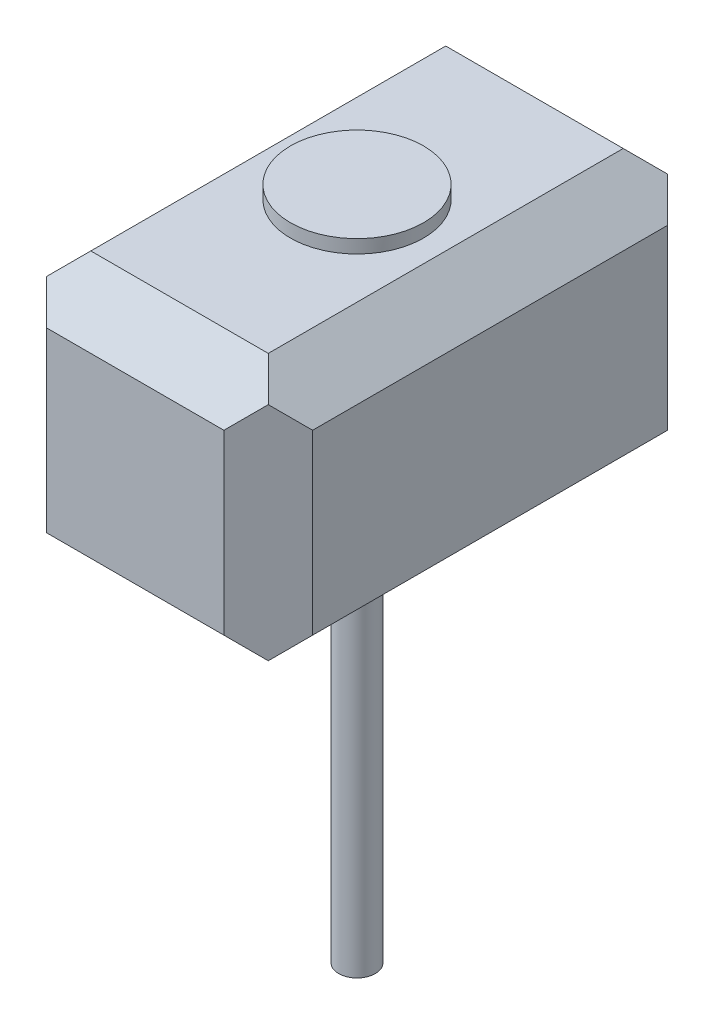
ISO-10303-21;
HEADER;
FILE_DESCRIPTION(('STEP AP214'),'2;1');
FILE_NAME('part.step','',(''),(''),'','','');
FILE_SCHEMA(('AUTOMOTIVE_DESIGN { 1 0 10303 214 1 1 1 1 }'));
ENDSEC;
DATA;
#1=APPLICATION_CONTEXT('core data for automotive mechanical design processes');
#2=APPLICATION_PROTOCOL_DEFINITION('international standard','automotive_design',2000,#1);
#3=PRODUCT_CONTEXT('',#1,'mechanical');
#4=PRODUCT('Part','Part','',(#3));
#5=PRODUCT_RELATED_PRODUCT_CATEGORY('part','',(#4));
#6=PRODUCT_DEFINITION_FORMATION('','',#4);
#7=PRODUCT_DEFINITION_CONTEXT('part definition',#1,'design');
#8=PRODUCT_DEFINITION('design','',#6,#7);
#9=PRODUCT_DEFINITION_SHAPE('','',#8);
#10=(LENGTH_UNIT() NAMED_UNIT(*) SI_UNIT(.MILLI.,.METRE.));
#11=(NAMED_UNIT(*) PLANE_ANGLE_UNIT() SI_UNIT($,.RADIAN.));
#12=(NAMED_UNIT(*) SI_UNIT($,.STERADIAN.) SOLID_ANGLE_UNIT());
#13=UNCERTAINTY_MEASURE_WITH_UNIT(LENGTH_MEASURE(1.E-05),#10,'distance_accuracy_value','');
#14=(GEOMETRIC_REPRESENTATION_CONTEXT(3) GLOBAL_UNCERTAINTY_ASSIGNED_CONTEXT((#13)) GLOBAL_UNIT_ASSIGNED_CONTEXT((#10,
#11,#12)) REPRESENTATION_CONTEXT('',''));
#15=CARTESIAN_POINT('',(0.,0.,0.));
#16=DIRECTION('',(0.,0.,1.));
#17=DIRECTION('',(1.,0.,0.));
#18=AXIS2_PLACEMENT_3D('',#15,#16,#17);
#19=CARTESIAN_POINT('',(-30.,-30.,100.));
#20=DIRECTION('',(0.,1.,0.));
#21=DIRECTION('',(0.,0.,1.));
#22=AXIS2_PLACEMENT_3D('',#19,#20,#21);
#23=PLANE('',#22);
#24=DIRECTION('',(1.,0.,0.));
#25=VECTOR('',#24,1.);
#26=CARTESIAN_POINT('',(-30.,-30.,9.99999999999999));
#27=LINE('',#26,#25);
#28=CARTESIAN_POINT('',(-30.,-30.,10.));
#29=VERTEX_POINT('',#28);
#30=CARTESIAN_POINT('',(19.9999999999999,-30.,9.99999999999999));
#31=VERTEX_POINT('',#30);
#32=EDGE_CURVE('E153',#29,#31,#27,.T.);
#33=ORIENTED_EDGE('',*,*,#32,.T.);
#34=DIRECTION('',(0.,0.,1.));
#35=VECTOR('',#34,1.);
#36=CARTESIAN_POINT('',(19.9999999999999,-30.,100.));
#37=LINE('',#36,#35);
#38=CARTESIAN_POINT('',(19.9999999999999,-30.,90.));
#39=VERTEX_POINT('',#38);
#40=EDGE_CURVE('E59',#31,#39,#37,.T.);
#41=ORIENTED_EDGE('',*,*,#40,.T.);
#42=DIRECTION('',(-1.,0.,0.));
#43=VECTOR('',#42,1.);
#44=CARTESIAN_POINT('',(-20.,-30.,90.));
#45=LINE('',#44,#43);
#46=CARTESIAN_POINT('',(-30.,-30.,90.));
#47=VERTEX_POINT('',#46);
#48=EDGE_CURVE('E154',#39,#47,#45,.T.);
#49=ORIENTED_EDGE('',*,*,#48,.T.);
#50=DIRECTION('',(0.,0.,-1.));
#51=VECTOR('',#50,1.);
#52=CARTESIAN_POINT('',(-30.,-30.,100.));
#53=LINE('',#52,#51);
#54=EDGE_CURVE('E142',#47,#29,#53,.T.);
#55=ORIENTED_EDGE('',*,*,#54,.T.);
#56=EDGE_LOOP('',(#33,#41,#49,#55));
#57=FACE_BOUND('',#56,.T.);
#58=CARTESIAN_POINT('',(0.,-30.,50.));
#59=DIRECTION('',(0.,1.,0.));
#60=DIRECTION('',(0.,0.,1.));
#61=AXIS2_PLACEMENT_3D('',#58,#59,#60);
#62=CIRCLE('',#61,4.13042740706519);
#63=CARTESIAN_POINT('',(0.,-30.,54.1304274070652));
#64=VERTEX_POINT('',#63);
#65=EDGE_CURVE('E217',#64,#64,#62,.F.);
#66=ORIENTED_EDGE('',*,*,#65,.F.);
#67=EDGE_LOOP('',(#66));
#68=FACE_BOUND('',#67,.T.);
#69=ADVANCED_FACE('F37',(#57,#68),#23,.F.);
#70=CARTESIAN_POINT('',(-30.,30.,100.));
#71=DIRECTION('',(0.,-1.,0.));
#72=DIRECTION('',(0.,0.,-1.));
#73=AXIS2_PLACEMENT_3D('',#70,#71,#72);
#74=PLANE('',#73);
#75=DIRECTION('',(-1.,0.,0.));
#76=VECTOR('',#75,1.);
#77=CARTESIAN_POINT('',(-30.,30.,9.99999999999999));
#78=LINE('',#77,#76);
#79=CARTESIAN_POINT('',(20.,30.,9.99999999999999));
#80=VERTEX_POINT('',#79);
#81=CARTESIAN_POINT('',(-20.,30.,9.99999999999999));
#82=VERTEX_POINT('',#81);
#83=EDGE_CURVE('E155',#80,#82,#78,.T.);
#84=ORIENTED_EDGE('',*,*,#83,.T.);
#85=DIRECTION('',(0.,0.,1.));
#86=VECTOR('',#85,1.);
#87=CARTESIAN_POINT('',(-20.,30.,100.));
#88=LINE('',#87,#86);
#89=CARTESIAN_POINT('',(-20.,30.,90.));
#90=VERTEX_POINT('',#89);
#91=EDGE_CURVE('E240',#82,#90,#88,.T.);
#92=ORIENTED_EDGE('',*,*,#91,.T.);
#93=DIRECTION('',(1.,0.,0.));
#94=VECTOR('',#93,1.);
#95=CARTESIAN_POINT('',(30.,30.,90.));
#96=LINE('',#95,#94);
#97=CARTESIAN_POINT('',(20.,30.,90.));
#98=VERTEX_POINT('',#97);
#99=EDGE_CURVE('E189',#90,#98,#96,.T.);
#100=ORIENTED_EDGE('',*,*,#99,.T.);
#101=DIRECTION('',(0.,0.,-1.));
#102=VECTOR('',#101,1.);
#103=CARTESIAN_POINT('',(20.,30.,100.));
#104=LINE('',#103,#102);
#105=EDGE_CURVE('E220',#98,#80,#104,.T.);
#106=ORIENTED_EDGE('',*,*,#105,.T.);
#107=EDGE_LOOP('',(#84,#92,#100,#106));
#108=FACE_BOUND('',#107,.T.);
#109=CARTESIAN_POINT('',(0.,30.,50.));
#110=DIRECTION('',(0.,-1.,0.));
#111=DIRECTION('',(0.,0.,-1.));
#112=AXIS2_PLACEMENT_3D('',#109,#110,#111);
#113=CIRCLE('',#112,15.);
#114=CARTESIAN_POINT('',(0.,30.,35.));
#115=VERTEX_POINT('',#114);
#116=EDGE_CURVE('E214',#115,#115,#113,.F.);
#117=ORIENTED_EDGE('',*,*,#116,.F.);
#118=EDGE_LOOP('',(#117));
#119=FACE_BOUND('',#118,.T.);
#120=ADVANCED_FACE('F301',(#108,#119),#74,.F.);
#121=CARTESIAN_POINT('',(30.,30.,100.));
#122=DIRECTION('',(-1.,0.,0.));
#123=DIRECTION('',(0.,-1.,0.));
#124=AXIS2_PLACEMENT_3D('',#121,#122,#123);
#125=PLANE('',#124);
#126=DIRECTION('',(0.,-1.,0.));
#127=VECTOR('',#126,1.);
#128=CARTESIAN_POINT('',(30.,-30.,90.));
#129=LINE('',#128,#127);
#130=CARTESIAN_POINT('',(30.,20.,90.));
#131=VERTEX_POINT('',#130);
#132=CARTESIAN_POINT('',(30.,-20.,90.));
#133=VERTEX_POINT('',#132);
#134=EDGE_CURVE('E196',#131,#133,#129,.T.);
#135=ORIENTED_EDGE('',*,*,#134,.T.);
#136=DIRECTION('',(0.,0.,-1.));
#137=VECTOR('',#136,1.);
#138=CARTESIAN_POINT('',(30.,-20.,100.));
#139=LINE('',#138,#137);
#140=CARTESIAN_POINT('',(30.,-19.9999999999999,10.));
#141=VERTEX_POINT('',#140);
#142=EDGE_CURVE('E246',#133,#141,#139,.T.);
#143=ORIENTED_EDGE('',*,*,#142,.T.);
#144=DIRECTION('',(0.,1.,0.));
#145=VECTOR('',#144,1.);
#146=CARTESIAN_POINT('',(30.,30.,10.));
#147=LINE('',#146,#145);
#148=CARTESIAN_POINT('',(30.,20.,10.));
#149=VERTEX_POINT('',#148);
#150=EDGE_CURVE('E165',#141,#149,#147,.T.);
#151=ORIENTED_EDGE('',*,*,#150,.T.);
#152=DIRECTION('',(0.,0.,1.));
#153=VECTOR('',#152,1.);
#154=CARTESIAN_POINT('',(30.,20.,100.));
#155=LINE('',#154,#153);
#156=EDGE_CURVE('E228',#149,#131,#155,.T.);
#157=ORIENTED_EDGE('',*,*,#156,.T.);
#158=EDGE_LOOP('',(#135,#143,#151,#157));
#159=FACE_BOUND('',#158,.T.);
#160=ADVANCED_FACE('F266',(#159),#125,.F.);
#161=CARTESIAN_POINT('',(-30.,30.,100.));
#162=DIRECTION('',(1.,0.,0.));
#163=DIRECTION('',(0.,1.,0.));
#164=AXIS2_PLACEMENT_3D('',#161,#162,#163);
#165=PLANE('',#164);
#166=DIRECTION('',(0.,1.,0.));
#167=VECTOR('',#166,1.);
#168=CARTESIAN_POINT('',(-30.,20.,90.));
#169=LINE('',#168,#167);
#170=CARTESIAN_POINT('',(-30.,20.,90.));
#171=VERTEX_POINT('',#170);
#172=EDGE_CURVE('E202',#47,#171,#169,.T.);
#173=ORIENTED_EDGE('',*,*,#172,.T.);
#174=DIRECTION('',(0.,0.,-1.));
#175=VECTOR('',#174,1.);
#176=CARTESIAN_POINT('',(-30.,20.,100.));
#177=LINE('',#176,#175);
#178=CARTESIAN_POINT('',(-30.,20.,10.));
#179=VERTEX_POINT('',#178);
#180=EDGE_CURVE('E145',#171,#179,#177,.T.);
#181=ORIENTED_EDGE('',*,*,#180,.T.);
#182=DIRECTION('',(0.,-1.,0.));
#183=VECTOR('',#182,1.);
#184=CARTESIAN_POINT('',(-30.,30.,10.));
#185=LINE('',#184,#183);
#186=EDGE_CURVE('E138',#179,#29,#185,.T.);
#187=ORIENTED_EDGE('',*,*,#186,.T.);
#188=ORIENTED_EDGE('',*,*,#54,.F.);
#189=EDGE_LOOP('',(#173,#181,#187,#188));
#190=FACE_BOUND('',#189,.T.);
#191=ADVANCED_FACE('F141',(#190),#165,.F.);
#192=CARTESIAN_POINT('',(0.,0.,100.));
#193=DIRECTION('',(0.,0.,1.));
#194=DIRECTION('',(1.,0.,0.));
#195=AXIS2_PLACEMENT_3D('',#192,#193,#194);
#196=PLANE('',#195);
#197=DIRECTION('',(0.,-1.,0.));
#198=VECTOR('',#197,1.);
#199=CARTESIAN_POINT('',(-20.,-30.,100.));
#200=LINE('',#199,#198);
#201=CARTESIAN_POINT('',(-20.,20.,100.));
#202=VERTEX_POINT('',#201);
#203=CARTESIAN_POINT('',(-20.,-20.,100.));
#204=VERTEX_POINT('',#203);
#205=EDGE_CURVE('E199',#202,#204,#200,.T.);
#206=ORIENTED_EDGE('',*,*,#205,.T.);
#207=DIRECTION('',(1.,0.,0.));
#208=VECTOR('',#207,1.);
#209=CARTESIAN_POINT('',(20.,-20.,100.));
#210=LINE('',#209,#208);
#211=CARTESIAN_POINT('',(20.,-20.,100.));
#212=VERTEX_POINT('',#211);
#213=EDGE_CURVE('E206',#204,#212,#210,.T.);
#214=ORIENTED_EDGE('',*,*,#213,.T.);
#215=DIRECTION('',(0.,1.,0.));
#216=VECTOR('',#215,1.);
#217=CARTESIAN_POINT('',(20.,20.,100.));
#218=LINE('',#217,#216);
#219=CARTESIAN_POINT('',(20.,20.,100.));
#220=VERTEX_POINT('',#219);
#221=EDGE_CURVE('E191',#212,#220,#218,.T.);
#222=ORIENTED_EDGE('',*,*,#221,.T.);
#223=DIRECTION('',(-1.,0.,0.));
#224=VECTOR('',#223,1.);
#225=CARTESIAN_POINT('',(-30.,20.,100.));
#226=LINE('',#225,#224);
#227=EDGE_CURVE('E186',#220,#202,#226,.T.);
#228=ORIENTED_EDGE('',*,*,#227,.T.);
#229=EDGE_LOOP('',(#206,#214,#222,#228));
#230=FACE_BOUND('',#229,.T.);
#231=ADVANCED_FACE('F281',(#230),#196,.T.);
#232=CARTESIAN_POINT('',(0.,0.,0.));
#233=DIRECTION('',(0.,0.,1.));
#234=DIRECTION('',(1.,0.,0.));
#235=AXIS2_PLACEMENT_3D('',#232,#233,#234);
#236=PLANE('',#235);
#237=DIRECTION('',(1.,0.,0.));
#238=VECTOR('',#237,1.);
#239=CARTESIAN_POINT('',(0.,20.,0.));
#240=LINE('',#239,#238);
#241=CARTESIAN_POINT('',(-19.9999999999999,20.,0.));
#242=VERTEX_POINT('',#241);
#243=CARTESIAN_POINT('',(19.9999999999999,20.,0.));
#244=VERTEX_POINT('',#243);
#245=EDGE_CURVE('E149',#242,#244,#240,.T.);
#246=ORIENTED_EDGE('',*,*,#245,.T.);
#247=DIRECTION('',(0.,-1.,0.));
#248=VECTOR('',#247,1.);
#249=CARTESIAN_POINT('',(20.,0.,0.));
#250=LINE('',#249,#248);
#251=CARTESIAN_POINT('',(19.9999999999999,-20.,0.));
#252=VERTEX_POINT('',#251);
#253=EDGE_CURVE('E182',#244,#252,#250,.T.);
#254=ORIENTED_EDGE('',*,*,#253,.T.);
#255=DIRECTION('',(-1.,0.,0.));
#256=VECTOR('',#255,1.);
#257=CARTESIAN_POINT('',(0.,-20.,0.));
#258=LINE('',#257,#256);
#259=CARTESIAN_POINT('',(-20.,-19.9999999999999,0.));
#260=VERTEX_POINT('',#259);
#261=EDGE_CURVE('E166',#252,#260,#258,.T.);
#262=ORIENTED_EDGE('',*,*,#261,.T.);
#263=DIRECTION('',(0.,1.,0.));
#264=VECTOR('',#263,1.);
#265=CARTESIAN_POINT('',(-20.,0.,0.));
#266=LINE('',#265,#264);
#267=EDGE_CURVE('E148',#260,#242,#266,.T.);
#268=ORIENTED_EDGE('',*,*,#267,.T.);
#269=EDGE_LOOP('',(#246,#254,#262,#268));
#270=FACE_BOUND('',#269,.T.);
#271=ADVANCED_FACE('F310',(#270),#236,.F.);
#272=CARTESIAN_POINT('',(-30.,30.,9.99999999999999));
#273=DIRECTION('',(0.,-0.707106781186546,0.707106781186549));
#274=DIRECTION('',(-1.,0.,0.));
#275=AXIS2_PLACEMENT_3D('',#272,#273,#274);
#276=PLANE('',#275);
#277=DIRECTION('',(-0.577350269189626,0.577350269189627,0.577350269189625));
#278=VECTOR('',#277,1.);
#279=CARTESIAN_POINT('',(-30.,30.,10.));
#280=LINE('',#279,#278);
#281=CARTESIAN_POINT('',(-25.,25.,5.00000000000002));
#282=VERTEX_POINT('',#281);
#283=EDGE_CURVE('E172',#242,#282,#280,.T.);
#284=ORIENTED_EDGE('',*,*,#283,.T.);
#285=DIRECTION('',(0.577350269189628,0.577350269189626,0.577350269189624));
#286=VECTOR('',#285,1.);
#287=CARTESIAN_POINT('',(-23.3333333333333,26.6666666666666,6.66666666666665));
#288=LINE('',#287,#286);
#289=EDGE_CURVE('E238',#282,#82,#288,.T.);
#290=ORIENTED_EDGE('',*,*,#289,.T.);
#291=ORIENTED_EDGE('',*,*,#83,.F.);
#292=DIRECTION('',(0.577350269189625,-0.577350269189627,-0.577350269189625));
#293=VECTOR('',#292,1.);
#294=CARTESIAN_POINT('',(3.33333333333333,46.6666666666667,26.6666666666666));
#295=LINE('',#294,#293);
#296=CARTESIAN_POINT('',(25.,25.,5.00000000000001));
#297=VERTEX_POINT('',#296);
#298=EDGE_CURVE('E223',#80,#297,#295,.T.);
#299=ORIENTED_EDGE('',*,*,#298,.T.);
#300=DIRECTION('',(-0.577350269189626,-0.577350269189627,-0.577350269189625));
#301=VECTOR('',#300,1.);
#302=CARTESIAN_POINT('',(9.99999999999996,9.99999999999996,-9.99999999999996));
#303=LINE('',#302,#301);
#304=EDGE_CURVE('E180',#297,#244,#303,.T.);
#305=ORIENTED_EDGE('',*,*,#304,.T.);
#306=ORIENTED_EDGE('',*,*,#245,.F.);
#307=EDGE_LOOP('',(#284,#290,#291,#299,#305,#306));
#308=FACE_BOUND('',#307,.T.);
#309=ADVANCED_FACE('F316',(#308),#276,.F.);
#310=CARTESIAN_POINT('',(-30.,30.,10.));
#311=DIRECTION('',(0.707106781186547,0.,0.707106781186549));
#312=DIRECTION('',(0.,-1.,0.));
#313=AXIS2_PLACEMENT_3D('',#310,#311,#312);
#314=PLANE('',#313);
#315=ORIENTED_EDGE('',*,*,#186,.F.);
#316=DIRECTION('',(0.577350269189627,0.577350269189625,-0.577350269189625));
#317=VECTOR('',#316,1.);
#318=CARTESIAN_POINT('',(-26.6666666666667,23.3333333333333,6.66666666666669));
#319=LINE('',#318,#317);
#320=EDGE_CURVE('E236',#179,#282,#319,.T.);
#321=ORIENTED_EDGE('',*,*,#320,.T.);
#322=ORIENTED_EDGE('',*,*,#283,.F.);
#323=ORIENTED_EDGE('',*,*,#267,.F.);
#324=DIRECTION('',(-0.577350269189626,-0.577350269189627,0.577350269189625));
#325=VECTOR('',#324,1.);
#326=CARTESIAN_POINT('',(-9.99999999999996,-9.99999999999993,-9.99999999999997));
#327=LINE('',#326,#325);
#328=EDGE_CURVE('E160',#260,#29,#327,.T.);
#329=ORIENTED_EDGE('',*,*,#328,.T.);
#330=EDGE_LOOP('',(#315,#321,#322,#323,#329));
#331=FACE_BOUND('',#330,.T.);
#332=ADVANCED_FACE('F161',(#331),#314,.F.);
#333=CARTESIAN_POINT('',(-30.,-30.,9.99999999999999));
#334=DIRECTION('',(0.,0.707106781186546,0.707106781186549));
#335=DIRECTION('',(1.,0.,0.));
#336=AXIS2_PLACEMENT_3D('',#333,#334,#335);
#337=PLANE('',#336);
#338=DIRECTION('',(0.577350269189626,-0.577350269189627,0.577350269189625));
#339=VECTOR('',#338,1.);
#340=CARTESIAN_POINT('',(9.99999999999996,-9.99999999999995,-9.99999999999996));
#341=LINE('',#340,#339);
#342=CARTESIAN_POINT('',(25.,-25.,5.));
#343=VERTEX_POINT('',#342);
#344=EDGE_CURVE('E184',#252,#343,#341,.T.);
#345=ORIENTED_EDGE('',*,*,#344,.T.);
#346=DIRECTION('',(-0.577350269189628,-0.577350269189626,0.577350269189624));
#347=VECTOR('',#346,1.);
#348=CARTESIAN_POINT('',(3.33333333333317,-46.6666666666667,26.6666666666666));
#349=LINE('',#348,#347);
#350=EDGE_CURVE('E171',#343,#31,#349,.T.);
#351=ORIENTED_EDGE('',*,*,#350,.T.);
#352=ORIENTED_EDGE('',*,*,#32,.F.);
#353=ORIENTED_EDGE('',*,*,#328,.F.);
#354=ORIENTED_EDGE('',*,*,#261,.F.);
#355=EDGE_LOOP('',(#345,#351,#352,#353,#354));
#356=FACE_BOUND('',#355,.T.);
#357=ADVANCED_FACE('F169',(#356),#337,.F.);
#358=CARTESIAN_POINT('',(30.,30.,10.));
#359=DIRECTION('',(-0.707106781186547,0.,0.707106781186548));
#360=DIRECTION('',(0.,1.,0.));
#361=AXIS2_PLACEMENT_3D('',#358,#359,#360);
#362=PLANE('',#361);
#363=ORIENTED_EDGE('',*,*,#150,.F.);
#364=DIRECTION('',(-0.577350269189627,-0.577350269189625,-0.577350269189625));
#365=VECTOR('',#364,1.);
#366=CARTESIAN_POINT('',(46.6666666666667,-3.33333333333333,26.6666666666666));
#367=LINE('',#366,#365);
#368=EDGE_CURVE('E249',#141,#343,#367,.T.);
#369=ORIENTED_EDGE('',*,*,#368,.T.);
#370=ORIENTED_EDGE('',*,*,#344,.F.);
#371=ORIENTED_EDGE('',*,*,#253,.F.);
#372=ORIENTED_EDGE('',*,*,#304,.F.);
#373=DIRECTION('',(0.577350269189626,-0.577350269189627,0.577350269189624));
#374=VECTOR('',#373,1.);
#375=CARTESIAN_POINT('',(26.6666666666666,23.3333333333333,6.66666666666666));
#376=LINE('',#375,#374);
#377=EDGE_CURVE('E225',#297,#149,#376,.T.);
#378=ORIENTED_EDGE('',*,*,#377,.T.);
#379=EDGE_LOOP('',(#363,#369,#370,#371,#372,#378));
#380=FACE_BOUND('',#379,.T.);
#381=ADVANCED_FACE('F255',(#380),#362,.F.);
#382=CARTESIAN_POINT('',(0.,20.,100.));
#383=DIRECTION('',(0.,0.707106781186549,0.707106781186547));
#384=DIRECTION('',(1.,0.,0.));
#385=AXIS2_PLACEMENT_3D('',#382,#383,#384);
#386=PLANE('',#385);
#387=ORIENTED_EDGE('',*,*,#99,.F.);
#388=DIRECTION('',(0.577350269189626,0.577350269189625,-0.577350269189626));
#389=VECTOR('',#388,1.);
#390=CARTESIAN_POINT('',(-20.,30.,90.));
#391=LINE('',#390,#389);
#392=CARTESIAN_POINT('',(-25.,25.,95.));
#393=VERTEX_POINT('',#392);
#394=EDGE_CURVE('E242',#90,#393,#391,.F.);
#395=ORIENTED_EDGE('',*,*,#394,.T.);
#396=DIRECTION('',(0.577350269189625,-0.577350269189625,0.577350269189627));
#397=VECTOR('',#396,1.);
#398=CARTESIAN_POINT('',(-13.3333333333333,13.3333333333333,106.666666666667));
#399=LINE('',#398,#397);
#400=EDGE_CURVE('E204',#393,#202,#399,.T.);
#401=ORIENTED_EDGE('',*,*,#400,.T.);
#402=ORIENTED_EDGE('',*,*,#227,.F.);
#403=DIRECTION('',(0.577350269189626,0.577350269189625,-0.577350269189627));
#404=VECTOR('',#403,1.);
#405=CARTESIAN_POINT('',(13.3333333333333,13.3333333333333,106.666666666667));
#406=LINE('',#405,#404);
#407=CARTESIAN_POINT('',(25.,25.,95.));
#408=VERTEX_POINT('',#407);
#409=EDGE_CURVE('E193',#220,#408,#406,.T.);
#410=ORIENTED_EDGE('',*,*,#409,.T.);
#411=DIRECTION('',(0.577350269189624,-0.577350269189626,0.577350269189627));
#412=VECTOR('',#411,1.);
#413=CARTESIAN_POINT('',(20.,30.,90.));
#414=LINE('',#413,#412);
#415=EDGE_CURVE('E232',#408,#98,#414,.F.);
#416=ORIENTED_EDGE('',*,*,#415,.T.);
#417=EDGE_LOOP('',(#387,#395,#401,#402,#410,#416));
#418=FACE_BOUND('',#417,.T.);
#419=ADVANCED_FACE('F277',(#418),#386,.T.);
#420=CARTESIAN_POINT('',(20.,0.,100.));
#421=DIRECTION('',(0.707106781186548,0.,0.707106781186547));
#422=DIRECTION('',(0.,-1.,0.));
#423=AXIS2_PLACEMENT_3D('',#420,#421,#422);
#424=PLANE('',#423);
#425=DIRECTION('',(0.577350269189626,-0.577350269189625,-0.577350269189627));
#426=VECTOR('',#425,1.);
#427=CARTESIAN_POINT('',(13.3333333333333,-13.3333333333333,106.666666666667));
#428=LINE('',#427,#426);
#429=CARTESIAN_POINT('',(25.,-25.,95.));
#430=VERTEX_POINT('',#429);
#431=EDGE_CURVE('E209',#212,#430,#428,.T.);
#432=ORIENTED_EDGE('',*,*,#431,.T.);
#433=DIRECTION('',(-0.577350269189626,-0.577350269189625,0.577350269189627));
#434=VECTOR('',#433,1.);
#435=CARTESIAN_POINT('',(30.,-20.,90.));
#436=LINE('',#435,#434);
#437=EDGE_CURVE('E11',#430,#133,#436,.F.);
#438=ORIENTED_EDGE('',*,*,#437,.T.);
#439=ORIENTED_EDGE('',*,*,#134,.F.);
#440=DIRECTION('',(0.577350269189625,-0.577350269189627,-0.577350269189626));
#441=VECTOR('',#440,1.);
#442=CARTESIAN_POINT('',(30.,20.,90.));
#443=LINE('',#442,#441);
#444=EDGE_CURVE('E230',#131,#408,#443,.F.);
#445=ORIENTED_EDGE('',*,*,#444,.T.);
#446=ORIENTED_EDGE('',*,*,#409,.F.);
#447=ORIENTED_EDGE('',*,*,#221,.F.);
#448=EDGE_LOOP('',(#432,#438,#439,#445,#446,#447));
#449=FACE_BOUND('',#448,.T.);
#450=ADVANCED_FACE('F262',(#449),#424,.T.);
#451=CARTESIAN_POINT('',(-20.,0.,100.));
#452=DIRECTION('',(-0.707106781186549,0.,0.707106781186547));
#453=DIRECTION('',(0.,1.,0.));
#454=AXIS2_PLACEMENT_3D('',#451,#452,#453);
#455=PLANE('',#454);
#456=ORIENTED_EDGE('',*,*,#400,.F.);
#457=DIRECTION('',(0.577350269189626,0.577350269189624,0.577350269189627));
#458=VECTOR('',#457,1.);
#459=CARTESIAN_POINT('',(-30.,20.,90.));
#460=LINE('',#459,#458);
#461=EDGE_CURVE('E244',#393,#171,#460,.F.);
#462=ORIENTED_EDGE('',*,*,#461,.T.);
#463=ORIENTED_EDGE('',*,*,#172,.F.);
#464=DIRECTION('',(0.577350269189625,0.577350269189625,0.577350269189627));
#465=VECTOR('',#464,1.);
#466=CARTESIAN_POINT('',(-13.3333333333333,-13.3333333333333,106.666666666667));
#467=LINE('',#466,#465);
#468=EDGE_CURVE('E212',#47,#204,#467,.T.);
#469=ORIENTED_EDGE('',*,*,#468,.T.);
#470=ORIENTED_EDGE('',*,*,#205,.F.);
#471=EDGE_LOOP('',(#456,#462,#463,#469,#470));
#472=FACE_BOUND('',#471,.T.);
#473=ADVANCED_FACE('F284',(#472),#455,.T.);
#474=CARTESIAN_POINT('',(0.,-20.,100.));
#475=DIRECTION('',(0.,-0.707106781186549,0.707106781186547));
#476=DIRECTION('',(-1.,0.,0.));
#477=AXIS2_PLACEMENT_3D('',#474,#475,#476);
#478=PLANE('',#477);
#479=ORIENTED_EDGE('',*,*,#48,.F.);
#480=DIRECTION('',(-0.577350269189626,-0.577350269189625,-0.577350269189626));
#481=VECTOR('',#480,1.);
#482=CARTESIAN_POINT('',(20.,-30.,90.));
#483=LINE('',#482,#481);
#484=EDGE_CURVE('E45',#39,#430,#483,.F.);
#485=ORIENTED_EDGE('',*,*,#484,.T.);
#486=ORIENTED_EDGE('',*,*,#431,.F.);
#487=ORIENTED_EDGE('',*,*,#213,.F.);
#488=ORIENTED_EDGE('',*,*,#468,.F.);
#489=EDGE_LOOP('',(#479,#485,#486,#487,#488));
#490=FACE_BOUND('',#489,.T.);
#491=ADVANCED_FACE('F287',(#490),#478,.T.);
#492=CARTESIAN_POINT('',(0.,33.,50.));
#493=DIRECTION('',(0.,-1.,0.));
#494=DIRECTION('',(0.,0.,-1.));
#495=AXIS2_PLACEMENT_3D('',#492,#493,#494);
#496=CYLINDRICAL_SURFACE('',#495,15.);
#497=CARTESIAN_POINT('',(0.,33.,50.));
#498=DIRECTION('',(0.,1.,0.));
#499=DIRECTION('',(0.,0.,1.));
#500=AXIS2_PLACEMENT_3D('',#497,#498,#499);
#501=CIRCLE('',#500,15.);
#502=CARTESIAN_POINT('',(0.,33.,65.));
#503=VERTEX_POINT('',#502);
#504=EDGE_CURVE('E156',#503,#503,#501,.T.);
#505=ORIENTED_EDGE('',*,*,#504,.F.);
#506=EDGE_LOOP('',(#505));
#507=FACE_BOUND('',#506,.T.);
#508=ORIENTED_EDGE('',*,*,#116,.T.);
#509=EDGE_LOOP('',(#508));
#510=FACE_BOUND('',#509,.T.);
#511=ADVANCED_FACE('F289',(#507,#510),#496,.T.);
#512=CARTESIAN_POINT('',(0.,33.,50.));
#513=DIRECTION('',(0.,1.,0.));
#514=DIRECTION('',(0.,0.,1.));
#515=AXIS2_PLACEMENT_3D('',#512,#513,#514);
#516=PLANE('',#515);
#517=ORIENTED_EDGE('',*,*,#504,.T.);
#518=EDGE_LOOP('',(#517));
#519=FACE_BOUND('',#518,.T.);
#520=ADVANCED_FACE('F295',(#519),#516,.T.);
#521=CARTESIAN_POINT('',(0.,-119.,50.));
#522=DIRECTION('',(0.,1.,0.));
#523=DIRECTION('',(0.,0.,1.));
#524=AXIS2_PLACEMENT_3D('',#521,#522,#523);
#525=CYLINDRICAL_SURFACE('',#524,4.13042740706519);
#526=CARTESIAN_POINT('',(0.,-119.,50.));
#527=DIRECTION('',(0.,-1.,0.));
#528=DIRECTION('',(0.,0.,-1.));
#529=AXIS2_PLACEMENT_3D('',#526,#527,#528);
#530=CIRCLE('',#529,4.13042740706519);
#531=CARTESIAN_POINT('',(0.,-119.,45.8695725929349));
#532=VERTEX_POINT('',#531);
#533=EDGE_CURVE('E458',#532,#532,#530,.T.);
#534=ORIENTED_EDGE('',*,*,#533,.F.);
#535=EDGE_LOOP('',(#534));
#536=FACE_BOUND('',#535,.T.);
#537=ORIENTED_EDGE('',*,*,#65,.T.);
#538=EDGE_LOOP('',(#537));
#539=FACE_BOUND('',#538,.T.);
#540=ADVANCED_FACE('F431',(#536,#539),#525,.T.);
#541=CARTESIAN_POINT('',(0.,-119.,50.));
#542=DIRECTION('',(0.,-1.,0.));
#543=DIRECTION('',(0.,0.,-1.));
#544=AXIS2_PLACEMENT_3D('',#541,#542,#543);
#545=PLANE('',#544);
#546=ORIENTED_EDGE('',*,*,#533,.T.);
#547=EDGE_LOOP('',(#546));
#548=FACE_BOUND('',#547,.T.);
#549=ADVANCED_FACE('F423',(#548),#545,.T.);
#550=CARTESIAN_POINT('',(20.,30.,100.));
#551=DIRECTION('',(-0.707106781186549,-0.707106781186547,0.));
#552=DIRECTION('',(0.,0.,-1.));
#553=AXIS2_PLACEMENT_3D('',#550,#551,#552);
#554=PLANE('',#553);
#555=ORIENTED_EDGE('',*,*,#444,.F.);
#556=ORIENTED_EDGE('',*,*,#156,.F.);
#557=ORIENTED_EDGE('',*,*,#377,.F.);
#558=ORIENTED_EDGE('',*,*,#298,.F.);
#559=ORIENTED_EDGE('',*,*,#105,.F.);
#560=ORIENTED_EDGE('',*,*,#415,.F.);
#561=EDGE_LOOP('',(#555,#556,#557,#558,#559,#560));
#562=FACE_BOUND('',#561,.T.);
#563=ADVANCED_FACE('F270',(#562),#554,.F.);
#564=CARTESIAN_POINT('',(-30.,20.,100.));
#565=DIRECTION('',(0.707106781186547,-0.707106781186549,0.));
#566=DIRECTION('',(0.,0.,-1.));
#567=AXIS2_PLACEMENT_3D('',#564,#565,#566);
#568=PLANE('',#567);
#569=ORIENTED_EDGE('',*,*,#394,.F.);
#570=ORIENTED_EDGE('',*,*,#91,.F.);
#571=ORIENTED_EDGE('',*,*,#289,.F.);
#572=ORIENTED_EDGE('',*,*,#320,.F.);
#573=ORIENTED_EDGE('',*,*,#180,.F.);
#574=ORIENTED_EDGE('',*,*,#461,.F.);
#575=EDGE_LOOP('',(#569,#570,#571,#572,#573,#574));
#576=FACE_BOUND('',#575,.T.);
#577=ADVANCED_FACE('F347',(#576),#568,.F.);
#578=CARTESIAN_POINT('',(30.,-20.,100.));
#579=DIRECTION('',(-0.707106781186547,0.707106781186548,0.));
#580=DIRECTION('',(0.,0.,-1.));
#581=AXIS2_PLACEMENT_3D('',#578,#579,#580);
#582=PLANE('',#581);
#583=ORIENTED_EDGE('',*,*,#484,.F.);
#584=ORIENTED_EDGE('',*,*,#40,.F.);
#585=ORIENTED_EDGE('',*,*,#350,.F.);
#586=ORIENTED_EDGE('',*,*,#368,.F.);
#587=ORIENTED_EDGE('',*,*,#142,.F.);
#588=ORIENTED_EDGE('',*,*,#437,.F.);
#589=EDGE_LOOP('',(#583,#584,#585,#586,#587,#588));
#590=FACE_BOUND('',#589,.T.);
#591=ADVANCED_FACE('F39',(#590),#582,.F.);
#592=CLOSED_SHELL('',(#69,#120,#160,#191,#231,#271,#309,#332,#357,#381,#419,#450,#473,#491,#511,
#520,#540,#549,#563,#577,#591));
#593=MANIFOLD_SOLID_BREP('B2',#592);
#594=ADVANCED_BREP_SHAPE_REPRESENTATION('',(#18,#593),#14);
#595=SHAPE_DEFINITION_REPRESENTATION(#9,#594);
ENDSEC;
END-ISO-10303-21;
